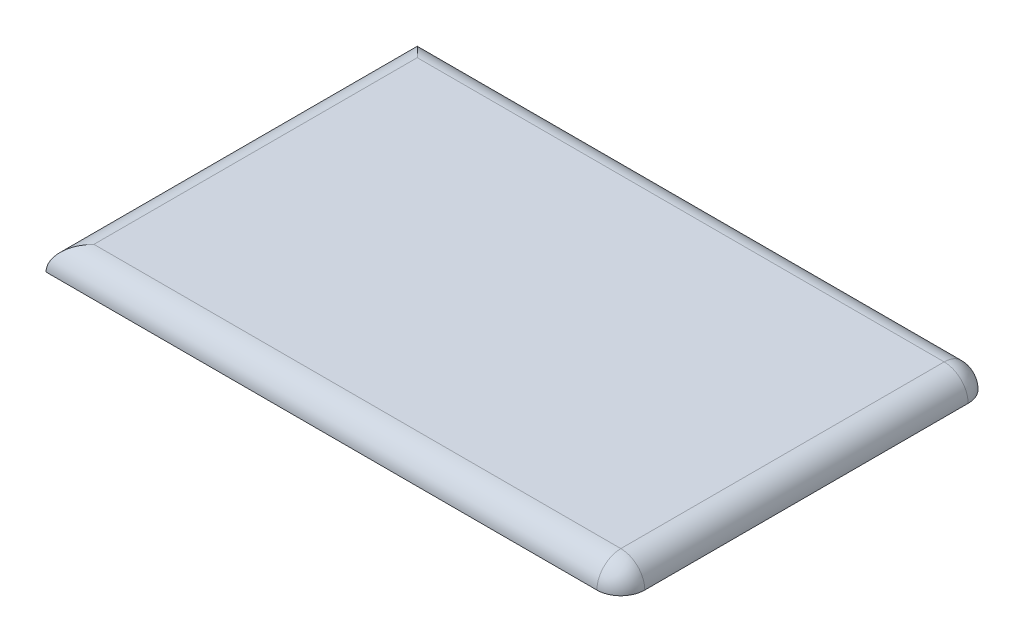
ISO-10303-21;
HEADER;
FILE_DESCRIPTION(('STEP AP214'),'2;1');
FILE_NAME('part.step','',(''),(''),'','','');
FILE_SCHEMA(('AUTOMOTIVE_DESIGN { 1 0 10303 214 1 1 1 1 }'));
ENDSEC;
DATA;
#1=APPLICATION_CONTEXT('core data for automotive mechanical design processes');
#2=APPLICATION_PROTOCOL_DEFINITION('international standard','automotive_design',2000,#1);
#3=PRODUCT_CONTEXT('',#1,'mechanical');
#4=PRODUCT('Part','Part','',(#3));
#5=PRODUCT_RELATED_PRODUCT_CATEGORY('part','',(#4));
#6=PRODUCT_DEFINITION_FORMATION('','',#4);
#7=PRODUCT_DEFINITION_CONTEXT('part definition',#1,'design');
#8=PRODUCT_DEFINITION('design','',#6,#7);
#9=PRODUCT_DEFINITION_SHAPE('','',#8);
#10=(LENGTH_UNIT() NAMED_UNIT(*) SI_UNIT(.MILLI.,.METRE.));
#11=(NAMED_UNIT(*) PLANE_ANGLE_UNIT() SI_UNIT($,.RADIAN.));
#12=(NAMED_UNIT(*) SI_UNIT($,.STERADIAN.) SOLID_ANGLE_UNIT());
#13=UNCERTAINTY_MEASURE_WITH_UNIT(LENGTH_MEASURE(1.E-05),#10,'distance_accuracy_value','');
#14=(GEOMETRIC_REPRESENTATION_CONTEXT(3) GLOBAL_UNCERTAINTY_ASSIGNED_CONTEXT((#13)) GLOBAL_UNIT_ASSIGNED_CONTEXT((#10,
#11,#12)) REPRESENTATION_CONTEXT('',''));
#15=CARTESIAN_POINT('',(0.,0.,0.));
#16=DIRECTION('',(0.,0.,1.));
#17=DIRECTION('',(1.,0.,0.));
#18=AXIS2_PLACEMENT_3D('',#15,#16,#17);
#19=CARTESIAN_POINT('',(0.,5.,0.));
#20=DIRECTION('',(0.,-1.,0.));
#21=DIRECTION('',(0.,0.,-1.));
#22=AXIS2_PLACEMENT_3D('',#19,#20,#21);
#23=PLANE('',#22);
#24=DIRECTION('',(1.,0.,0.));
#25=VECTOR('',#24,1.);
#26=CARTESIAN_POINT('',(0.,5.,-72.5));
#27=LINE('',#26,#25);
#28=CARTESIAN_POINT('',(115.,5.,-72.5));
#29=VERTEX_POINT('',#28);
#30=CARTESIAN_POINT('',(5.,5.,-72.5));
#31=VERTEX_POINT('',#30);
#32=EDGE_CURVE('E42',#29,#31,#27,.F.);
#33=ORIENTED_EDGE('',*,*,#32,.T.);
#34=DIRECTION('',(0.,0.,-1.));
#35=VECTOR('',#34,1.);
#36=CARTESIAN_POINT('',(5.,5.,0.));
#37=LINE('',#36,#35);
#38=CARTESIAN_POINT('',(5.,5.,-5.));
#39=VERTEX_POINT('',#38);
#40=EDGE_CURVE('E11',#31,#39,#37,.F.);
#41=ORIENTED_EDGE('',*,*,#40,.T.);
#42=DIRECTION('',(-1.,0.,0.));
#43=VECTOR('',#42,1.);
#44=CARTESIAN_POINT('',(120.,5.,-5.));
#45=LINE('',#44,#43);
#46=CARTESIAN_POINT('',(115.,5.,-5.));
#47=VERTEX_POINT('',#46);
#48=EDGE_CURVE('E100',#39,#47,#45,.F.);
#49=ORIENTED_EDGE('',*,*,#48,.T.);
#50=DIRECTION('',(0.,0.,1.));
#51=VECTOR('',#50,1.);
#52=CARTESIAN_POINT('',(115.,5.,-77.5));
#53=LINE('',#52,#51);
#54=EDGE_CURVE('E53',#47,#29,#53,.F.);
#55=ORIENTED_EDGE('',*,*,#54,.T.);
#56=EDGE_LOOP('',(#33,#41,#49,#55));
#57=FACE_BOUND('',#56,.T.);
#58=ADVANCED_FACE('F33',(#57),#23,.F.);
#59=CARTESIAN_POINT('',(0.,0.,0.));
#60=DIRECTION('',(0.,-1.,0.));
#61=DIRECTION('',(0.,0.,-1.));
#62=AXIS2_PLACEMENT_3D('',#59,#60,#61);
#63=PLANE('',#62);
#64=DIRECTION('',(0.,0.,1.));
#65=VECTOR('',#64,1.);
#66=CARTESIAN_POINT('',(120.,0.,-77.5));
#67=LINE('',#66,#65);
#68=CARTESIAN_POINT('',(120.,0.,-72.5));
#69=VERTEX_POINT('',#68);
#70=CARTESIAN_POINT('',(120.,0.,-5.));
#71=VERTEX_POINT('',#70);
#72=EDGE_CURVE('E89',#69,#71,#67,.T.);
#73=ORIENTED_EDGE('',*,*,#72,.T.);
#74=CARTESIAN_POINT('',(115.,0.,-5.));
#75=DIRECTION('',(0.,-1.,0.));
#76=DIRECTION('',(0.,0.,-1.));
#77=AXIS2_PLACEMENT_3D('',#74,#75,#76);
#78=CIRCLE('',#77,5.);
#79=CARTESIAN_POINT('',(115.,0.,0.));
#80=VERTEX_POINT('',#79);
#81=EDGE_CURVE('E85',#71,#80,#78,.T.);
#82=ORIENTED_EDGE('',*,*,#81,.T.);
#83=DIRECTION('',(-1.,0.,0.));
#84=VECTOR('',#83,1.);
#85=CARTESIAN_POINT('',(120.,0.,0.));
#86=LINE('',#85,#84);
#87=CARTESIAN_POINT('',(0.,0.,0.));
#88=VERTEX_POINT('',#87);
#89=EDGE_CURVE('E79',#80,#88,#86,.T.);
#90=ORIENTED_EDGE('',*,*,#89,.T.);
#91=DIRECTION('',(0.,0.,-1.));
#92=VECTOR('',#91,1.);
#93=CARTESIAN_POINT('',(0.,0.,0.));
#94=LINE('',#93,#92);
#95=CARTESIAN_POINT('',(0.,0.,-77.5));
#96=VERTEX_POINT('',#95);
#97=EDGE_CURVE('E82',#88,#96,#94,.T.);
#98=ORIENTED_EDGE('',*,*,#97,.T.);
#99=DIRECTION('',(1.,0.,0.));
#100=VECTOR('',#99,1.);
#101=CARTESIAN_POINT('',(0.,0.,-77.5));
#102=LINE('',#101,#100);
#103=CARTESIAN_POINT('',(115.,0.,-77.5));
#104=VERTEX_POINT('',#103);
#105=EDGE_CURVE('E97',#96,#104,#102,.T.);
#106=ORIENTED_EDGE('',*,*,#105,.T.);
#107=CARTESIAN_POINT('',(115.,0.,-72.5));
#108=DIRECTION('',(0.,-1.,0.));
#109=DIRECTION('',(0.,0.,-1.));
#110=AXIS2_PLACEMENT_3D('',#107,#108,#109);
#111=CIRCLE('',#110,5.);
#112=EDGE_CURVE('E117',#104,#69,#111,.T.);
#113=ORIENTED_EDGE('',*,*,#112,.T.);
#114=EDGE_LOOP('',(#73,#82,#90,#98,#106,#113));
#115=FACE_BOUND('',#114,.T.);
#116=ADVANCED_FACE('F81',(#115),#63,.T.);
#117=CARTESIAN_POINT('',(0.,0.,-72.5));
#118=DIRECTION('',(-1.,0.,0.));
#119=DIRECTION('',(0.,0.,1.));
#120=AXIS2_PLACEMENT_3D('',#117,#118,#119);
#121=CYLINDRICAL_SURFACE('',#120,5.);
#122=CARTESIAN_POINT('',(115.,0.,-72.5));
#123=DIRECTION('',(1.,0.,0.));
#124=DIRECTION('',(0.,0.,-1.));
#125=AXIS2_PLACEMENT_3D('',#122,#123,#124);
#126=CIRCLE('',#125,5.);
#127=EDGE_CURVE('E101',#104,#29,#126,.T.);
#128=ORIENTED_EDGE('',*,*,#127,.F.);
#129=ORIENTED_EDGE('',*,*,#105,.F.);
#130=CARTESIAN_POINT('',(5.,0.,-72.5));
#131=DIRECTION('',(-0.707106781186547,0.,0.707106781186547));
#132=DIRECTION('',(-0.707106781186547,0.,-0.707106781186547));
#133=AXIS2_PLACEMENT_3D('',#130,#131,#132);
#134=ELLIPSE('',#133,7.07106781186547,5.);
#135=EDGE_CURVE('E37',#31,#96,#134,.T.);
#136=ORIENTED_EDGE('',*,*,#135,.F.);
#137=ORIENTED_EDGE('',*,*,#32,.F.);
#138=EDGE_LOOP('',(#128,#129,#136,#137));
#139=FACE_BOUND('',#138,.T.);
#140=ADVANCED_FACE('F35',(#139),#121,.T.);
#141=CARTESIAN_POINT('',(5.,0.,0.));
#142=DIRECTION('',(0.,0.,1.));
#143=DIRECTION('',(1.,0.,0.));
#144=AXIS2_PLACEMENT_3D('',#141,#142,#143);
#145=CYLINDRICAL_SURFACE('',#144,5.);
#146=ORIENTED_EDGE('',*,*,#135,.T.);
#147=ORIENTED_EDGE('',*,*,#97,.F.);
#148=CARTESIAN_POINT('',(5.,0.,-5.));
#149=DIRECTION('',(0.707106781186547,0.,0.707106781186547));
#150=DIRECTION('',(0.707106781186547,0.,-0.707106781186547));
#151=AXIS2_PLACEMENT_3D('',#148,#149,#150);
#152=ELLIPSE('',#151,7.07106781186547,5.);
#153=EDGE_CURVE('E96',#39,#88,#152,.T.);
#154=ORIENTED_EDGE('',*,*,#153,.F.);
#155=ORIENTED_EDGE('',*,*,#40,.F.);
#156=EDGE_LOOP('',(#146,#147,#154,#155));
#157=FACE_BOUND('',#156,.T.);
#158=ADVANCED_FACE('F94',(#157),#145,.T.);
#159=CARTESIAN_POINT('',(115.,0.,-72.5));
#160=DIRECTION('',(0.,0.,1.));
#161=DIRECTION('',(1.,0.,0.));
#162=AXIS2_PLACEMENT_3D('',#159,#160,#161);
#163=SPHERICAL_SURFACE('',#162,5.);
#164=ORIENTED_EDGE('',*,*,#112,.F.);
#165=ORIENTED_EDGE('',*,*,#127,.T.);
#166=CARTESIAN_POINT('',(115.,0.,-72.5));
#167=DIRECTION('',(0.,0.,-1.));
#168=DIRECTION('',(-1.,0.,0.));
#169=AXIS2_PLACEMENT_3D('',#166,#167,#168);
#170=CIRCLE('',#169,5.);
#171=EDGE_CURVE('E102',#69,#29,#170,.F.);
#172=ORIENTED_EDGE('',*,*,#171,.F.);
#173=EDGE_LOOP('',(#164,#165,#172));
#174=FACE_BOUND('',#173,.T.);
#175=ADVANCED_FACE('F147',(#174),#163,.T.);
#176=CARTESIAN_POINT('',(120.,0.,-5.));
#177=DIRECTION('',(1.,0.,0.));
#178=DIRECTION('',(0.,0.,-1.));
#179=AXIS2_PLACEMENT_3D('',#176,#177,#178);
#180=CYLINDRICAL_SURFACE('',#179,5.);
#181=ORIENTED_EDGE('',*,*,#153,.T.);
#182=ORIENTED_EDGE('',*,*,#89,.F.);
#183=CARTESIAN_POINT('',(115.,0.,-5.));
#184=DIRECTION('',(1.,0.,0.));
#185=DIRECTION('',(0.,0.,-1.));
#186=AXIS2_PLACEMENT_3D('',#183,#184,#185);
#187=CIRCLE('',#186,5.);
#188=EDGE_CURVE('E106',#47,#80,#187,.T.);
#189=ORIENTED_EDGE('',*,*,#188,.F.);
#190=ORIENTED_EDGE('',*,*,#48,.F.);
#191=EDGE_LOOP('',(#181,#182,#189,#190));
#192=FACE_BOUND('',#191,.T.);
#193=ADVANCED_FACE('F99',(#192),#180,.T.);
#194=CARTESIAN_POINT('',(115.,0.,-77.5));
#195=DIRECTION('',(0.,0.,-1.));
#196=DIRECTION('',(-1.,0.,0.));
#197=AXIS2_PLACEMENT_3D('',#194,#195,#196);
#198=CYLINDRICAL_SURFACE('',#197,5.);
#199=ORIENTED_EDGE('',*,*,#171,.T.);
#200=ORIENTED_EDGE('',*,*,#54,.F.);
#201=CARTESIAN_POINT('',(115.,0.,-5.));
#202=DIRECTION('',(0.,0.,1.));
#203=DIRECTION('',(0.,-1.,0.));
#204=AXIS2_PLACEMENT_3D('',#201,#202,#203);
#205=CIRCLE('',#204,5.);
#206=EDGE_CURVE('E110',#71,#47,#205,.T.);
#207=ORIENTED_EDGE('',*,*,#206,.F.);
#208=ORIENTED_EDGE('',*,*,#72,.F.);
#209=EDGE_LOOP('',(#199,#200,#207,#208));
#210=FACE_BOUND('',#209,.T.);
#211=ADVANCED_FACE('F125',(#210),#198,.T.);
#212=CARTESIAN_POINT('',(115.,0.,-5.));
#213=DIRECTION('',(0.,0.,1.));
#214=DIRECTION('',(1.,0.,0.));
#215=AXIS2_PLACEMENT_3D('',#212,#213,#214);
#216=SPHERICAL_SURFACE('',#215,5.);
#217=ORIENTED_EDGE('',*,*,#81,.F.);
#218=ORIENTED_EDGE('',*,*,#206,.T.);
#219=ORIENTED_EDGE('',*,*,#188,.T.);
#220=EDGE_LOOP('',(#217,#218,#219));
#221=FACE_BOUND('',#220,.T.);
#222=ADVANCED_FACE('F127',(#221),#216,.T.);
#223=CLOSED_SHELL('',(#58,#116,#140,#158,#175,#193,#211,#222));
#224=MANIFOLD_SOLID_BREP('B2',#223);
#225=ADVANCED_BREP_SHAPE_REPRESENTATION('',(#18,#224),#14);
#226=SHAPE_DEFINITION_REPRESENTATION(#9,#225);
ENDSEC;
END-ISO-10303-21;
